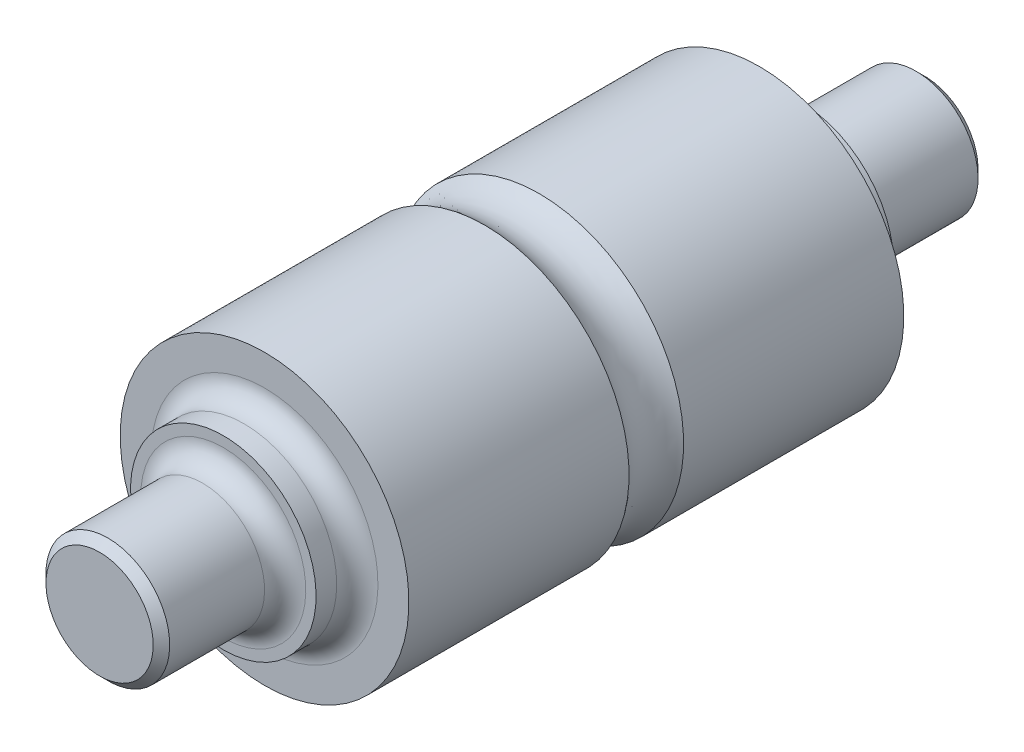
ISO-10303-21;
HEADER;
FILE_DESCRIPTION(('STEP AP214'),'2;1');
FILE_NAME('part.step','',(''),(''),'','','');
FILE_SCHEMA(('AUTOMOTIVE_DESIGN { 1 0 10303 214 1 1 1 1 }'));
ENDSEC;
DATA;
#1=APPLICATION_CONTEXT('core data for automotive mechanical design processes');
#2=APPLICATION_PROTOCOL_DEFINITION('international standard','automotive_design',2000,#1);
#3=PRODUCT_CONTEXT('',#1,'mechanical');
#4=PRODUCT('Part','Part','',(#3));
#5=PRODUCT_RELATED_PRODUCT_CATEGORY('part','',(#4));
#6=PRODUCT_DEFINITION_FORMATION('','',#4);
#7=PRODUCT_DEFINITION_CONTEXT('part definition',#1,'design');
#8=PRODUCT_DEFINITION('design','',#6,#7);
#9=PRODUCT_DEFINITION_SHAPE('','',#8);
#10=(LENGTH_UNIT() NAMED_UNIT(*) SI_UNIT(.MILLI.,.METRE.));
#11=(NAMED_UNIT(*) PLANE_ANGLE_UNIT() SI_UNIT($,.RADIAN.));
#12=(NAMED_UNIT(*) SI_UNIT($,.STERADIAN.) SOLID_ANGLE_UNIT());
#13=UNCERTAINTY_MEASURE_WITH_UNIT(LENGTH_MEASURE(1.E-05),#10,'distance_accuracy_value','');
#14=(GEOMETRIC_REPRESENTATION_CONTEXT(3) GLOBAL_UNCERTAINTY_ASSIGNED_CONTEXT((#13)) GLOBAL_UNIT_ASSIGNED_CONTEXT((#10,
#11,#12)) REPRESENTATION_CONTEXT('',''));
#15=CARTESIAN_POINT('',(0.,0.,0.));
#16=DIRECTION('',(0.,0.,1.));
#17=DIRECTION('',(1.,0.,0.));
#18=AXIS2_PLACEMENT_3D('',#15,#16,#17);
#19=CARTESIAN_POINT('',(0.,0.,-100.));
#20=DIRECTION('',(0.,0.,1.));
#21=DIRECTION('',(0.,-1.,0.));
#22=AXIS2_PLACEMENT_3D('',#19,#20,#21);
#23=PLANE('',#22);
#24=CARTESIAN_POINT('',(0.,0.,-100.));
#25=DIRECTION('',(0.,0.,1.));
#26=DIRECTION('',(0.,-1.,0.));
#27=AXIS2_PLACEMENT_3D('',#24,#25,#26);
#28=CIRCLE('',#27,13.);
#29=CARTESIAN_POINT('',(0.,-13.,-100.));
#30=VERTEX_POINT('',#29);
#31=EDGE_CURVE('E87',#30,#30,#28,.F.);
#32=ORIENTED_EDGE('',*,*,#31,.T.);
#33=EDGE_LOOP('',(#32));
#34=FACE_BOUND('',#33,.T.);
#35=ADVANCED_FACE('F39',(#34),#23,.F.);
#36=CARTESIAN_POINT('',(0.,0.,100.));
#37=DIRECTION('',(0.,0.,1.));
#38=DIRECTION('',(0.,-1.,0.));
#39=AXIS2_PLACEMENT_3D('',#36,#37,#38);
#40=CYLINDRICAL_SURFACE('',#39,15.);
#41=CARTESIAN_POINT('',(0.,0.,-75.));
#42=DIRECTION('',(0.,0.,1.));
#43=DIRECTION('',(0.,-1.,0.));
#44=AXIS2_PLACEMENT_3D('',#41,#42,#43);
#45=CIRCLE('',#44,15.);
#46=CARTESIAN_POINT('',(0.,-15.,-75.));
#47=VERTEX_POINT('',#46);
#48=EDGE_CURVE('E71',#47,#47,#45,.F.);
#49=ORIENTED_EDGE('',*,*,#48,.T.);
#50=EDGE_LOOP('',(#49));
#51=FACE_BOUND('',#50,.T.);
#52=CARTESIAN_POINT('',(0.,0.,-98.0000000000001));
#53=DIRECTION('',(0.,0.,1.));
#54=DIRECTION('',(0.,-1.,0.));
#55=AXIS2_PLACEMENT_3D('',#52,#53,#54);
#56=CIRCLE('',#55,15.);
#57=CARTESIAN_POINT('',(0.,-15.,-98.0000000000001));
#58=VERTEX_POINT('',#57);
#59=EDGE_CURVE('E91',#58,#58,#56,.T.);
#60=ORIENTED_EDGE('',*,*,#59,.T.);
#61=EDGE_LOOP('',(#60));
#62=FACE_BOUND('',#61,.T.);
#63=ADVANCED_FACE('F137',(#51,#62),#40,.T.);
#64=CARTESIAN_POINT('',(0.,15.,-70.));
#65=DIRECTION('',(0.,0.,1.));
#66=DIRECTION('',(0.,-1.,0.));
#67=AXIS2_PLACEMENT_3D('',#64,#65,#66);
#68=PLANE('',#67);
#69=CARTESIAN_POINT('',(0.,0.,-70.));
#70=DIRECTION('',(0.,0.,1.));
#71=DIRECTION('',(0.,-1.,0.));
#72=AXIS2_PLACEMENT_3D('',#69,#70,#71);
#73=CIRCLE('',#72,20.);
#74=CARTESIAN_POINT('',(0.,-20.,-70.));
#75=VERTEX_POINT('',#74);
#76=EDGE_CURVE('E75',#75,#75,#73,.T.);
#77=ORIENTED_EDGE('',*,*,#76,.T.);
#78=EDGE_LOOP('',(#77));
#79=FACE_BOUND('',#78,.T.);
#80=CARTESIAN_POINT('',(0.,0.,-70.));
#81=DIRECTION('',(0.,0.,1.));
#82=DIRECTION('',(0.,-1.,0.));
#83=AXIS2_PLACEMENT_3D('',#80,#81,#82);
#84=CIRCLE('',#83,22.5);
#85=CARTESIAN_POINT('',(0.,-22.5,-70.));
#86=VERTEX_POINT('',#85);
#87=EDGE_CURVE('E95',#86,#86,#84,.T.);
#88=ORIENTED_EDGE('',*,*,#87,.F.);
#89=EDGE_LOOP('',(#88));
#90=FACE_BOUND('',#89,.T.);
#91=ADVANCED_FACE('F143',(#79,#90),#68,.F.);
#92=CARTESIAN_POINT('',(0.,0.,100.));
#93=DIRECTION('',(0.,0.,1.));
#94=DIRECTION('',(0.,-1.,0.));
#95=AXIS2_PLACEMENT_3D('',#92,#93,#94);
#96=CYLINDRICAL_SURFACE('',#95,22.5);
#97=CARTESIAN_POINT('',(0.,0.,-65.));
#98=DIRECTION('',(0.,0.,1.));
#99=DIRECTION('',(0.,-1.,0.));
#100=AXIS2_PLACEMENT_3D('',#97,#98,#99);
#101=CIRCLE('',#100,22.5);
#102=CARTESIAN_POINT('',(0.,-22.5,-65.));
#103=VERTEX_POINT('',#102);
#104=EDGE_CURVE('E63',#103,#103,#101,.F.);
#105=ORIENTED_EDGE('',*,*,#104,.T.);
#106=EDGE_LOOP('',(#105));
#107=FACE_BOUND('',#106,.T.);
#108=ORIENTED_EDGE('',*,*,#87,.T.);
#109=EDGE_LOOP('',(#108));
#110=FACE_BOUND('',#109,.T.);
#111=ADVANCED_FACE('F202',(#107,#110),#96,.T.);
#112=CARTESIAN_POINT('',(0.,35.,-60.));
#113=DIRECTION('',(0.,0.,1.));
#114=DIRECTION('',(0.,-1.,0.));
#115=AXIS2_PLACEMENT_3D('',#112,#113,#114);
#116=PLANE('',#115);
#117=CARTESIAN_POINT('',(0.,0.,-60.));
#118=DIRECTION('',(0.,0.,1.));
#119=DIRECTION('',(0.,-1.,0.));
#120=AXIS2_PLACEMENT_3D('',#117,#118,#119);
#121=CIRCLE('',#120,27.5);
#122=CARTESIAN_POINT('',(0.,-27.5,-60.));
#123=VERTEX_POINT('',#122);
#124=EDGE_CURVE('E67',#123,#123,#121,.T.);
#125=ORIENTED_EDGE('',*,*,#124,.T.);
#126=EDGE_LOOP('',(#125));
#127=FACE_BOUND('',#126,.T.);
#128=CARTESIAN_POINT('',(0.,0.,-60.));
#129=DIRECTION('',(0.,0.,1.));
#130=DIRECTION('',(0.,-1.,0.));
#131=AXIS2_PLACEMENT_3D('',#128,#129,#130);
#132=CIRCLE('',#131,35.);
#133=CARTESIAN_POINT('',(0.,-35.,-60.));
#134=VERTEX_POINT('',#133);
#135=EDGE_CURVE('E99',#134,#134,#132,.T.);
#136=ORIENTED_EDGE('',*,*,#135,.F.);
#137=EDGE_LOOP('',(#136));
#138=FACE_BOUND('',#137,.T.);
#139=ADVANCED_FACE('F197',(#127,#138),#116,.F.);
#140=CARTESIAN_POINT('',(0.,0.,100.));
#141=DIRECTION('',(0.,0.,1.));
#142=DIRECTION('',(0.,-1.,0.));
#143=AXIS2_PLACEMENT_3D('',#140,#141,#142);
#144=CYLINDRICAL_SURFACE('',#143,35.);
#145=CARTESIAN_POINT('',(0.,0.,-6.61437827766148));
#146=DIRECTION('',(0.,0.,1.));
#147=DIRECTION('',(0.,-1.,0.));
#148=AXIS2_PLACEMENT_3D('',#145,#146,#147);
#149=CIRCLE('',#148,35.);
#150=CARTESIAN_POINT('',(0.,-35.,-6.61437827766149));
#151=VERTEX_POINT('',#150);
#152=EDGE_CURVE('E103',#151,#151,#149,.T.);
#153=ORIENTED_EDGE('',*,*,#152,.F.);
#154=EDGE_LOOP('',(#153));
#155=FACE_BOUND('',#154,.T.);
#156=ORIENTED_EDGE('',*,*,#135,.T.);
#157=EDGE_LOOP('',(#156));
#158=FACE_BOUND('',#157,.T.);
#159=ADVANCED_FACE('F191',(#155,#158),#144,.T.);
#160=CARTESIAN_POINT('',(0.,0.,0.));
#161=DIRECTION('',(0.,0.,1.));
#162=DIRECTION('',(0.,-1.,0.));
#163=AXIS2_PLACEMENT_3D('',#160,#161,#162);
#164=TOROIDAL_SURFACE('',#163,42.5,10.);
#165=CARTESIAN_POINT('',(0.,0.,6.61437827766149));
#166=DIRECTION('',(0.,0.,1.));
#167=DIRECTION('',(0.,-1.,0.));
#168=AXIS2_PLACEMENT_3D('',#165,#166,#167);
#169=CIRCLE('',#168,35.);
#170=CARTESIAN_POINT('',(0.,-35.,6.61437827766149));
#171=VERTEX_POINT('',#170);
#172=EDGE_CURVE('E107',#171,#171,#169,.T.);
#173=ORIENTED_EDGE('',*,*,#172,.F.);
#174=EDGE_LOOP('',(#173));
#175=FACE_BOUND('',#174,.T.);
#176=ORIENTED_EDGE('',*,*,#152,.T.);
#177=EDGE_LOOP('',(#176));
#178=FACE_BOUND('',#177,.T.);
#179=ADVANCED_FACE('F185',(#175,#178),#164,.F.);
#180=CARTESIAN_POINT('',(0.,0.,100.));
#181=DIRECTION('',(0.,0.,1.));
#182=DIRECTION('',(0.,-1.,0.));
#183=AXIS2_PLACEMENT_3D('',#180,#181,#182);
#184=CYLINDRICAL_SURFACE('',#183,35.);
#185=CARTESIAN_POINT('',(0.,0.,60.));
#186=DIRECTION('',(0.,0.,1.));
#187=DIRECTION('',(0.,-1.,0.));
#188=AXIS2_PLACEMENT_3D('',#185,#186,#187);
#189=CIRCLE('',#188,35.);
#190=CARTESIAN_POINT('',(0.,-35.,60.));
#191=VERTEX_POINT('',#190);
#192=EDGE_CURVE('E111',#191,#191,#189,.T.);
#193=ORIENTED_EDGE('',*,*,#192,.F.);
#194=EDGE_LOOP('',(#193));
#195=FACE_BOUND('',#194,.T.);
#196=ORIENTED_EDGE('',*,*,#172,.T.);
#197=EDGE_LOOP('',(#196));
#198=FACE_BOUND('',#197,.T.);
#199=ADVANCED_FACE('F133',(#195,#198),#184,.T.);
#200=CARTESIAN_POINT('',(0.,22.5,60.));
#201=DIRECTION('',(0.,0.,-1.));
#202=DIRECTION('',(0.,1.,0.));
#203=AXIS2_PLACEMENT_3D('',#200,#201,#202);
#204=PLANE('',#203);
#205=CARTESIAN_POINT('',(0.,0.,60.));
#206=DIRECTION('',(0.,0.,-1.));
#207=DIRECTION('',(0.,1.,0.));
#208=AXIS2_PLACEMENT_3D('',#205,#206,#207);
#209=CIRCLE('',#208,27.5);
#210=CARTESIAN_POINT('',(0.,27.5,60.));
#211=VERTEX_POINT('',#210);
#212=EDGE_CURVE('E52',#211,#211,#209,.T.);
#213=ORIENTED_EDGE('',*,*,#212,.T.);
#214=EDGE_LOOP('',(#213));
#215=FACE_BOUND('',#214,.T.);
#216=ORIENTED_EDGE('',*,*,#192,.T.);
#217=EDGE_LOOP('',(#216));
#218=FACE_BOUND('',#217,.T.);
#219=ADVANCED_FACE('F124',(#215,#218),#204,.F.);
#220=CARTESIAN_POINT('',(0.,0.,100.));
#221=DIRECTION('',(0.,0.,1.));
#222=DIRECTION('',(0.,-1.,0.));
#223=AXIS2_PLACEMENT_3D('',#220,#221,#222);
#224=CYLINDRICAL_SURFACE('',#223,22.5);
#225=CARTESIAN_POINT('',(0.,0.,65.));
#226=DIRECTION('',(0.,0.,-1.));
#227=DIRECTION('',(0.,1.,0.));
#228=AXIS2_PLACEMENT_3D('',#225,#226,#227);
#229=CIRCLE('',#228,22.5);
#230=CARTESIAN_POINT('',(0.,22.5,65.));
#231=VERTEX_POINT('',#230);
#232=EDGE_CURVE('E57',#231,#231,#229,.F.);
#233=ORIENTED_EDGE('',*,*,#232,.T.);
#234=EDGE_LOOP('',(#233));
#235=FACE_BOUND('',#234,.T.);
#236=CARTESIAN_POINT('',(0.,0.,70.));
#237=DIRECTION('',(0.,0.,1.));
#238=DIRECTION('',(0.,-1.,0.));
#239=AXIS2_PLACEMENT_3D('',#236,#237,#238);
#240=CIRCLE('',#239,22.5);
#241=CARTESIAN_POINT('',(0.,-22.5,70.));
#242=VERTEX_POINT('',#241);
#243=EDGE_CURVE('E115',#242,#242,#240,.T.);
#244=ORIENTED_EDGE('',*,*,#243,.F.);
#245=EDGE_LOOP('',(#244));
#246=FACE_BOUND('',#245,.T.);
#247=ADVANCED_FACE('F122',(#235,#246),#224,.T.);
#248=CARTESIAN_POINT('',(0.,15.,70.));
#249=DIRECTION('',(0.,0.,-1.));
#250=DIRECTION('',(0.,1.,0.));
#251=AXIS2_PLACEMENT_3D('',#248,#249,#250);
#252=PLANE('',#251);
#253=CARTESIAN_POINT('',(0.,0.,70.));
#254=DIRECTION('',(0.,0.,-1.));
#255=DIRECTION('',(0.,1.,0.));
#256=AXIS2_PLACEMENT_3D('',#253,#254,#255);
#257=CIRCLE('',#256,20.);
#258=CARTESIAN_POINT('',(0.,20.,70.));
#259=VERTEX_POINT('',#258);
#260=EDGE_CURVE('E10',#259,#259,#257,.T.);
#261=ORIENTED_EDGE('',*,*,#260,.T.);
#262=EDGE_LOOP('',(#261));
#263=FACE_BOUND('',#262,.T.);
#264=ORIENTED_EDGE('',*,*,#243,.T.);
#265=EDGE_LOOP('',(#264));
#266=FACE_BOUND('',#265,.T.);
#267=ADVANCED_FACE('F120',(#263,#266),#252,.F.);
#268=CARTESIAN_POINT('',(0.,0.,100.));
#269=DIRECTION('',(0.,0.,1.));
#270=DIRECTION('',(0.,-1.,0.));
#271=AXIS2_PLACEMENT_3D('',#268,#269,#270);
#272=CYLINDRICAL_SURFACE('',#271,15.);
#273=CARTESIAN_POINT('',(0.,0.,75.));
#274=DIRECTION('',(0.,0.,-1.));
#275=DIRECTION('',(0.,1.,0.));
#276=AXIS2_PLACEMENT_3D('',#273,#274,#275);
#277=CIRCLE('',#276,15.);
#278=CARTESIAN_POINT('',(0.,15.,75.));
#279=VERTEX_POINT('',#278);
#280=EDGE_CURVE('E47',#279,#279,#277,.F.);
#281=ORIENTED_EDGE('',*,*,#280,.T.);
#282=EDGE_LOOP('',(#281));
#283=FACE_BOUND('',#282,.T.);
#284=CARTESIAN_POINT('',(0.,0.,98.));
#285=DIRECTION('',(0.,0.,-1.));
#286=DIRECTION('',(0.,1.,0.));
#287=AXIS2_PLACEMENT_3D('',#284,#285,#286);
#288=CIRCLE('',#287,15.);
#289=CARTESIAN_POINT('',(0.,15.,98.));
#290=VERTEX_POINT('',#289);
#291=EDGE_CURVE('E79',#290,#290,#288,.T.);
#292=ORIENTED_EDGE('',*,*,#291,.T.);
#293=EDGE_LOOP('',(#292));
#294=FACE_BOUND('',#293,.T.);
#295=ADVANCED_FACE('F131',(#283,#294),#272,.T.);
#296=CARTESIAN_POINT('',(0.,0.,100.));
#297=DIRECTION('',(0.,0.,-1.));
#298=DIRECTION('',(0.,1.,0.));
#299=AXIS2_PLACEMENT_3D('',#296,#297,#298);
#300=PLANE('',#299);
#301=CARTESIAN_POINT('',(0.,0.,100.));
#302=DIRECTION('',(0.,0.,-1.));
#303=DIRECTION('',(0.,1.,0.));
#304=AXIS2_PLACEMENT_3D('',#301,#302,#303);
#305=CIRCLE('',#304,13.);
#306=CARTESIAN_POINT('',(0.,13.,100.));
#307=VERTEX_POINT('',#306);
#308=EDGE_CURVE('E83',#307,#307,#305,.F.);
#309=ORIENTED_EDGE('',*,*,#308,.T.);
#310=EDGE_LOOP('',(#309));
#311=FACE_BOUND('',#310,.T.);
#312=ADVANCED_FACE('F156',(#311),#300,.F.);
#313=CARTESIAN_POINT('',(0.,0.,-98.0000000000001));
#314=DIRECTION('',(0.,0.,1.));
#315=DIRECTION('',(0.,-1.,0.));
#316=AXIS2_PLACEMENT_3D('',#313,#314,#315);
#317=CONICAL_SURFACE('',#316,15.,0.785398163397452);
#318=ORIENTED_EDGE('',*,*,#31,.F.);
#319=EDGE_LOOP('',(#318));
#320=FACE_BOUND('',#319,.T.);
#321=ORIENTED_EDGE('',*,*,#59,.F.);
#322=EDGE_LOOP('',(#321));
#323=FACE_BOUND('',#322,.T.);
#324=ADVANCED_FACE('F149',(#320,#323),#317,.T.);
#325=CARTESIAN_POINT('',(0.,0.,100.));
#326=DIRECTION('',(0.,0.,-1.));
#327=DIRECTION('',(0.,1.,0.));
#328=AXIS2_PLACEMENT_3D('',#325,#326,#327);
#329=CONICAL_SURFACE('',#328,13.,0.785398163397441);
#330=ORIENTED_EDGE('',*,*,#291,.F.);
#331=EDGE_LOOP('',(#330));
#332=FACE_BOUND('',#331,.T.);
#333=ORIENTED_EDGE('',*,*,#308,.F.);
#334=EDGE_LOOP('',(#333));
#335=FACE_BOUND('',#334,.T.);
#336=ADVANCED_FACE('F155',(#332,#335),#329,.T.);
#337=CARTESIAN_POINT('',(0.,0.,-75.));
#338=DIRECTION('',(0.,0.,1.));
#339=DIRECTION('',(0.,-1.,0.));
#340=AXIS2_PLACEMENT_3D('',#337,#338,#339);
#341=TOROIDAL_SURFACE('',#340,20.,5.);
#342=ORIENTED_EDGE('',*,*,#48,.F.);
#343=EDGE_LOOP('',(#342));
#344=FACE_BOUND('',#343,.T.);
#345=ORIENTED_EDGE('',*,*,#76,.F.);
#346=EDGE_LOOP('',(#345));
#347=FACE_BOUND('',#346,.T.);
#348=ADVANCED_FACE('F162',(#344,#347),#341,.F.);
#349=CARTESIAN_POINT('',(0.,0.,-65.));
#350=DIRECTION('',(0.,0.,1.));
#351=DIRECTION('',(0.,-1.,0.));
#352=AXIS2_PLACEMENT_3D('',#349,#350,#351);
#353=TOROIDAL_SURFACE('',#352,27.5,5.);
#354=ORIENTED_EDGE('',*,*,#104,.F.);
#355=EDGE_LOOP('',(#354));
#356=FACE_BOUND('',#355,.T.);
#357=ORIENTED_EDGE('',*,*,#124,.F.);
#358=EDGE_LOOP('',(#357));
#359=FACE_BOUND('',#358,.T.);
#360=ADVANCED_FACE('F166',(#356,#359),#353,.F.);
#361=CARTESIAN_POINT('',(0.,0.,65.));
#362=DIRECTION('',(0.,0.,-1.));
#363=DIRECTION('',(0.,1.,0.));
#364=AXIS2_PLACEMENT_3D('',#361,#362,#363);
#365=TOROIDAL_SURFACE('',#364,27.5,5.);
#366=ORIENTED_EDGE('',*,*,#212,.F.);
#367=EDGE_LOOP('',(#366));
#368=FACE_BOUND('',#367,.T.);
#369=ORIENTED_EDGE('',*,*,#232,.F.);
#370=EDGE_LOOP('',(#369));
#371=FACE_BOUND('',#370,.T.);
#372=ADVANCED_FACE('F169',(#368,#371),#365,.F.);
#373=CARTESIAN_POINT('',(0.,0.,75.));
#374=DIRECTION('',(0.,0.,-1.));
#375=DIRECTION('',(0.,1.,0.));
#376=AXIS2_PLACEMENT_3D('',#373,#374,#375);
#377=TOROIDAL_SURFACE('',#376,20.,5.);
#378=ORIENTED_EDGE('',*,*,#260,.F.);
#379=EDGE_LOOP('',(#378));
#380=FACE_BOUND('',#379,.T.);
#381=ORIENTED_EDGE('',*,*,#280,.F.);
#382=EDGE_LOOP('',(#381));
#383=FACE_BOUND('',#382,.T.);
#384=ADVANCED_FACE('F41',(#380,#383),#377,.F.);
#385=CLOSED_SHELL('',(#35,#63,#91,#111,#139,#159,#179,#199,#219,#247,#267,#295,#312,#324,#336,
#348,#360,#372,#384));
#386=MANIFOLD_SOLID_BREP('B2',#385);
#387=ADVANCED_BREP_SHAPE_REPRESENTATION('',(#18,#386),#14);
#388=SHAPE_DEFINITION_REPRESENTATION(#9,#387);
ENDSEC;
END-ISO-10303-21;
